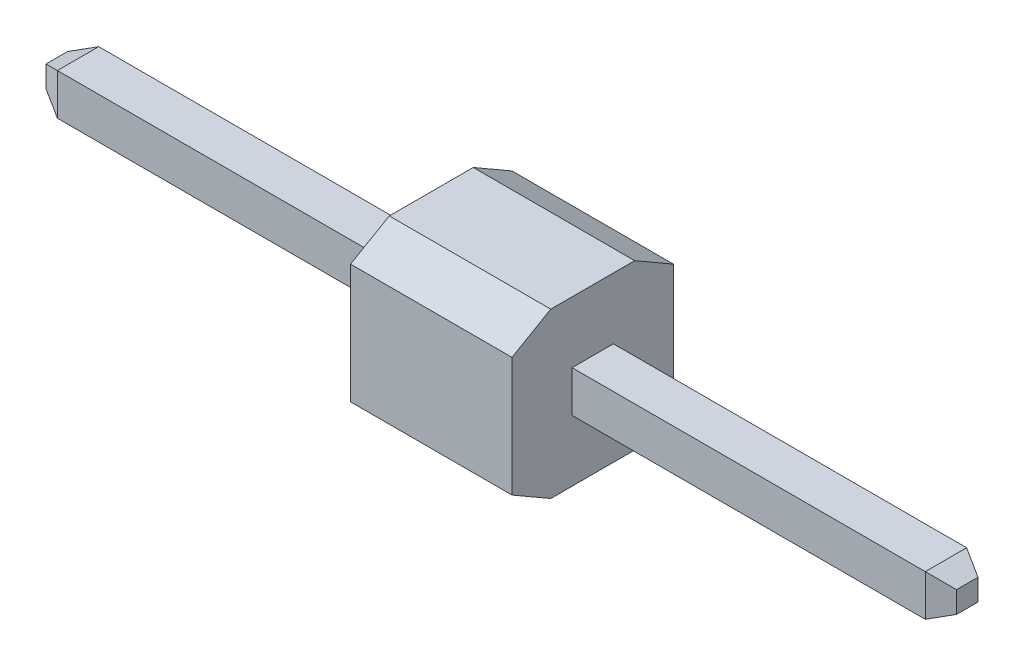
ISO-10303-21;
HEADER;
FILE_DESCRIPTION(('STEP AP214'),'2;1');
FILE_NAME('part.step','',(''),(''),'','','');
FILE_SCHEMA(('AUTOMOTIVE_DESIGN { 1 0 10303 214 1 1 1 1 }'));
ENDSEC;
DATA;
#1=APPLICATION_CONTEXT('core data for automotive mechanical design processes');
#2=APPLICATION_PROTOCOL_DEFINITION('international standard','automotive_design',2000,#1);
#3=PRODUCT_CONTEXT('',#1,'mechanical');
#4=PRODUCT('Part','Part','',(#3));
#5=PRODUCT_RELATED_PRODUCT_CATEGORY('part','',(#4));
#6=PRODUCT_DEFINITION_FORMATION('','',#4);
#7=PRODUCT_DEFINITION_CONTEXT('part definition',#1,'design');
#8=PRODUCT_DEFINITION('design','',#6,#7);
#9=PRODUCT_DEFINITION_SHAPE('','',#8);
#10=(LENGTH_UNIT() NAMED_UNIT(*) SI_UNIT(.MILLI.,.METRE.));
#11=(NAMED_UNIT(*) PLANE_ANGLE_UNIT() SI_UNIT($,.RADIAN.));
#12=(NAMED_UNIT(*) SI_UNIT($,.STERADIAN.) SOLID_ANGLE_UNIT());
#13=UNCERTAINTY_MEASURE_WITH_UNIT(LENGTH_MEASURE(1.E-05),#10,'distance_accuracy_value','');
#14=(GEOMETRIC_REPRESENTATION_CONTEXT(3) GLOBAL_UNCERTAINTY_ASSIGNED_CONTEXT((#13)) GLOBAL_UNIT_ASSIGNED_CONTEXT((#10,
#11,#12)) REPRESENTATION_CONTEXT('',''));
#15=CARTESIAN_POINT('',(0.,0.,0.));
#16=DIRECTION('',(0.,0.,1.));
#17=DIRECTION('',(1.,0.,0.));
#18=AXIS2_PLACEMENT_3D('',#15,#16,#17);
#19=CARTESIAN_POINT('',(5.42110120468803,7.93711572605714,-2.77112126172632));
#20=DIRECTION('',(1.,-9.93476518829084E-08,4.37113882867379E-08));
#21=DIRECTION('',(-9.93476589883358E-08,-1.,8.74227765734759E-08));
#22=AXIS2_PLACEMENT_3D('',#19,#20,#21);
#23=PLANE('',#22);
#24=DIRECTION('',(-1.18186632779335E-08,-0.50000007571054,-0.866025360072934));
#25=VECTOR('',#24,1.);
#26=CARTESIAN_POINT('',(5.42110101251343,6.69352602482091,-1.20112115300825));
#27=LINE('',#26,#25);
#28=CARTESIAN_POINT('',(5.42110101251343,6.69352602482091,-1.20112115300825));
#29=VERTEX_POINT('',#28);
#30=CARTESIAN_POINT('',(5.42110100432522,6.34711581085724,-1.80112112272411));
#31=VERTEX_POINT('',#30);
#32=EDGE_CURVE('E11',#29,#31,#27,.T.);
#33=ORIENTED_EDGE('',*,*,#32,.T.);
#34=DIRECTION('',(4.37113811813104E-08,-8.74227842254741E-08,-0.999999999999995));
#35=VECTOR('',#34,1.);
#36=CARTESIAN_POINT('',(5.42110100432522,6.34711581085724,-1.80112112272411));
#37=LINE('',#36,#35);
#38=CARTESIAN_POINT('',(5.42110106115001,6.34711569720762,-3.10112112272411));
#39=VERTEX_POINT('',#38);
#40=EDGE_CURVE('E304',#31,#39,#37,.T.);
#41=ORIENTED_EDGE('',*,*,#40,.T.);
#42=DIRECTION('',(8.75289963531793E-08,0.499999924289839,-0.866025447495712));
#43=VECTOR('',#42,1.);
#44=CARTESIAN_POINT('',(5.42110106115001,6.34711569720762,-3.10112112272411));
#45=LINE('',#44,#43);
#46=CARTESIAN_POINT('',(5.42110112179188,6.69352580626395,-3.70112115300825));
#47=VERTEX_POINT('',#46);
#48=EDGE_CURVE('E296',#39,#47,#45,.T.);
#49=ORIENTED_EDGE('',*,*,#48,.T.);
#50=DIRECTION('',(9.93476588436476E-08,0.999999999999991,-8.74227764822786E-08));
#51=VECTOR('',#50,1.);
#52=CARTESIAN_POINT('',(5.42110112179188,6.69352580626395,-3.70112115300825));
#53=LINE('',#52,#51);
#54=CARTESIAN_POINT('',(5.42110130530486,8.54070548323395,-3.70112131449382));
#55=VERTEX_POINT('',#54);
#56=EDGE_CURVE('E281',#47,#55,#53,.T.);
#57=ORIENTED_EDGE('',*,*,#56,.T.);
#58=DIRECTION('',(-1.18186632778483E-08,-0.500000075710534,-0.866025360072937));
#59=VECTOR('',#58,1.);
#60=CARTESIAN_POINT('',(5.42110131349307,8.88711569720762,-3.10112134477796));
#61=LINE('',#60,#59);
#62=CARTESIAN_POINT('',(5.42110131349307,8.88711569720762,-3.10112134477796));
#63=VERTEX_POINT('',#62);
#64=EDGE_CURVE('E265',#63,#55,#61,.T.);
#65=ORIENTED_EDGE('',*,*,#64,.F.);
#66=DIRECTION('',(4.37113811813104E-08,-8.74227842254741E-08,-0.999999999999995));
#67=VECTOR('',#66,1.);
#68=CARTESIAN_POINT('',(5.42110125666827,8.88711581085724,-1.80112134477796));
#69=LINE('',#68,#67);
#70=CARTESIAN_POINT('',(5.42110125666827,8.88711581085724,-1.80112134477796));
#71=VERTEX_POINT('',#70);
#72=EDGE_CURVE('E248',#71,#63,#69,.T.);
#73=ORIENTED_EDGE('',*,*,#72,.F.);
#74=DIRECTION('',(8.75289963525481E-08,0.499999924289833,-0.866025447495715));
#75=VECTOR('',#74,1.);
#76=CARTESIAN_POINT('',(5.4211011960264,8.54070570179091,-1.20112131449382));
#77=LINE('',#76,#75);
#78=CARTESIAN_POINT('',(5.4211011960264,8.54070570179091,-1.20112131449382));
#79=VERTEX_POINT('',#78);
#80=EDGE_CURVE('E242',#79,#71,#77,.T.);
#81=ORIENTED_EDGE('',*,*,#80,.F.);
#82=DIRECTION('',(9.93476588436476E-08,0.999999999999991,-8.74227762418639E-08));
#83=VECTOR('',#82,1.);
#84=CARTESIAN_POINT('',(5.42110101251343,6.69352602482091,-1.20112115300825));
#85=LINE('',#84,#83);
#86=EDGE_CURVE('E236',#29,#79,#85,.T.);
#87=ORIENTED_EDGE('',*,*,#86,.F.);
#88=EDGE_LOOP('',(#33,#41,#49,#57,#65,#73,#81,#87));
#89=FACE_BOUND('',#88,.T.);
#90=DIRECTION('',(-4.37113817364219E-08,8.74227856773042E-08,0.999999999999995));
#91=VECTOR('',#90,1.);
#92=CARTESIAN_POINT('',(5.42110114110553,7.29711572605714,-2.77112120577575));
#93=LINE('',#92,#91);
#94=CARTESIAN_POINT('',(5.42110114110553,7.29711572605714,-2.77112120577575));
#95=VERTEX_POINT('',#94);
#96=CARTESIAN_POINT('',(5.42110111313025,7.29711578200772,-2.13112120577575));
#97=VERTEX_POINT('',#96);
#98=EDGE_CURVE('E302',#95,#97,#93,.T.);
#99=ORIENTED_EDGE('',*,*,#98,.T.);
#100=DIRECTION('',(-9.93476592658906E-08,-0.999999999999991,8.74227766567418E-08));
#101=VECTOR('',#100,1.);
#102=CARTESIAN_POINT('',(5.42110117671275,7.93711578200772,-2.13112126172632));
#103=LINE('',#102,#101);
#104=CARTESIAN_POINT('',(5.42110117671275,7.93711578200772,-2.13112126172632));
#105=VERTEX_POINT('',#104);
#106=EDGE_CURVE('E293',#105,#97,#103,.T.);
#107=ORIENTED_EDGE('',*,*,#106,.F.);
#108=DIRECTION('',(-4.37113803486431E-08,8.74227856773043E-08,0.999999999999995));
#109=VECTOR('',#108,1.);
#110=CARTESIAN_POINT('',(5.42110120468803,7.93711572605714,-2.77112126172632));
#111=LINE('',#110,#109);
#112=CARTESIAN_POINT('',(5.42110120468803,7.93711572605714,-2.77112126172632));
#113=VERTEX_POINT('',#112);
#114=EDGE_CURVE('E278',#113,#105,#111,.T.);
#115=ORIENTED_EDGE('',*,*,#114,.F.);
#116=DIRECTION('',(-9.93476578781118E-08,-0.999999999999991,8.74227759628524E-08));
#117=VECTOR('',#116,1.);
#118=CARTESIAN_POINT('',(5.42110120468803,7.93711572605714,-2.77112126172632));
#119=LINE('',#118,#117);
#120=EDGE_CURVE('E263',#113,#95,#119,.T.);
#121=ORIENTED_EDGE('',*,*,#120,.T.);
#122=EDGE_LOOP('',(#99,#107,#115,#121));
#123=FACE_BOUND('',#122,.T.);
#124=ADVANCED_FACE('F17',(#89,#123),#23,.T.);
#125=CARTESIAN_POINT('',(2.92110120468803,7.93711597442627,-2.77112137100479));
#126=DIRECTION('',(1.,-9.93476518829084E-08,4.37113882867379E-08));
#127=DIRECTION('',(-9.93476589883358E-08,-1.,8.74227765734759E-08));
#128=AXIS2_PLACEMENT_3D('',#125,#126,#127);
#129=PLANE('',#128);
#130=DIRECTION('',(-1.1818662636946E-08,-0.50000007571054,-0.866025360072934));
#131=VECTOR('',#130,1.);
#132=CARTESIAN_POINT('',(2.92110101251343,6.69352627319004,-1.20112126228672));
#133=LINE('',#132,#131);
#134=CARTESIAN_POINT('',(2.92110101251343,6.69352627319004,-1.20112126228672));
#135=VERTEX_POINT('',#134);
#136=CARTESIAN_POINT('',(2.92110100432522,6.34711605922637,-1.80112123200258));
#137=VERTEX_POINT('',#136);
#138=EDGE_CURVE('E24',#135,#137,#133,.T.);
#139=ORIENTED_EDGE('',*,*,#138,.F.);
#140=DIRECTION('',(9.93476590840623E-08,0.999999999999991,-8.74227762418639E-08));
#141=VECTOR('',#140,1.);
#142=CARTESIAN_POINT('',(2.92110101251343,6.69352627319004,-1.20112126228672));
#143=LINE('',#142,#141);
#144=CARTESIAN_POINT('',(2.9211011960264,8.54070595016004,-1.20112142377229));
#145=VERTEX_POINT('',#144);
#146=EDGE_CURVE('E300',#135,#145,#143,.T.);
#147=ORIENTED_EDGE('',*,*,#146,.T.);
#148=DIRECTION('',(8.75289957115606E-08,0.499999924289833,-0.866025447495715));
#149=VECTOR('',#148,1.);
#150=CARTESIAN_POINT('',(2.9211011960264,8.54070595016004,-1.20112142377229));
#151=LINE('',#150,#149);
#152=CARTESIAN_POINT('',(2.92110125666827,8.88711605922637,-1.80112145405643));
#153=VERTEX_POINT('',#152);
#154=EDGE_CURVE('E286',#145,#153,#151,.T.);
#155=ORIENTED_EDGE('',*,*,#154,.T.);
#156=DIRECTION('',(4.37113811813104E-08,-8.74227842254741E-08,-0.999999999999995));
#157=VECTOR('',#156,1.);
#158=CARTESIAN_POINT('',(2.92110125666827,8.88711605922637,-1.80112145405643));
#159=LINE('',#158,#157);
#160=CARTESIAN_POINT('',(2.92110131349307,8.88711594557675,-3.10112145405643));
#161=VERTEX_POINT('',#160);
#162=EDGE_CURVE('E271',#153,#161,#159,.T.);
#163=ORIENTED_EDGE('',*,*,#162,.T.);
#164=DIRECTION('',(-1.18186626368607E-08,-0.500000075710534,-0.866025360072937));
#165=VECTOR('',#164,1.);
#166=CARTESIAN_POINT('',(2.92110131349307,8.88711594557675,-3.10112145405643));
#167=LINE('',#166,#165);
#168=CARTESIAN_POINT('',(2.92110130530486,8.54070573160308,-3.70112142377229));
#169=VERTEX_POINT('',#168);
#170=EDGE_CURVE('E253',#161,#169,#167,.T.);
#171=ORIENTED_EDGE('',*,*,#170,.T.);
#172=DIRECTION('',(9.93476590840623E-08,0.999999999999991,-8.74227764822786E-08));
#173=VECTOR('',#172,1.);
#174=CARTESIAN_POINT('',(2.92110112179188,6.69352605463308,-3.70112126228672));
#175=LINE('',#174,#173);
#176=CARTESIAN_POINT('',(2.92110112179188,6.69352605463308,-3.70112126228672));
#177=VERTEX_POINT('',#176);
#178=EDGE_CURVE('E261',#177,#169,#175,.T.);
#179=ORIENTED_EDGE('',*,*,#178,.F.);
#180=DIRECTION('',(8.75289957121918E-08,0.499999924289839,-0.866025447495712));
#181=VECTOR('',#180,1.);
#182=CARTESIAN_POINT('',(2.92110106115001,6.34711594557675,-3.10112123200258));
#183=LINE('',#182,#181);
#184=CARTESIAN_POINT('',(2.92110106115001,6.34711594557675,-3.10112123200258));
#185=VERTEX_POINT('',#184);
#186=EDGE_CURVE('E276',#185,#177,#183,.T.);
#187=ORIENTED_EDGE('',*,*,#186,.F.);
#188=DIRECTION('',(4.37113811813104E-08,-8.74227842254741E-08,-0.999999999999995));
#189=VECTOR('',#188,1.);
#190=CARTESIAN_POINT('',(2.92110100432522,6.34711605922637,-1.80112123200258));
#191=LINE('',#190,#189);
#192=EDGE_CURVE('E291',#137,#185,#191,.T.);
#193=ORIENTED_EDGE('',*,*,#192,.F.);
#194=EDGE_LOOP('',(#139,#147,#155,#163,#171,#179,#187,#193));
#195=FACE_BOUND('',#194,.T.);
#196=DIRECTION('',(-9.93476592658906E-08,-0.999999999999991,8.74227766567418E-08));
#197=VECTOR('',#196,1.);
#198=CARTESIAN_POINT('',(2.92110117671275,7.93711603037685,-2.13112137100479));
#199=LINE('',#198,#197);
#200=CARTESIAN_POINT('',(2.92110117671275,7.93711603037685,-2.13112137100479));
#201=VERTEX_POINT('',#200);
#202=CARTESIAN_POINT('',(2.92110111313025,7.29711603037685,-2.13112131505422));
#203=VERTEX_POINT('',#202);
#204=EDGE_CURVE('E298',#201,#203,#199,.T.);
#205=ORIENTED_EDGE('',*,*,#204,.T.);
#206=DIRECTION('',(-4.37113810425325E-08,8.74227856773042E-08,0.999999999999995));
#207=VECTOR('',#206,1.);
#208=CARTESIAN_POINT('',(2.92110114110553,7.29711597442627,-2.77112131505422));
#209=LINE('',#208,#207);
#210=CARTESIAN_POINT('',(2.92110114110553,7.29711597442627,-2.77112131505422));
#211=VERTEX_POINT('',#210);
#212=EDGE_CURVE('E283',#211,#203,#209,.T.);
#213=ORIENTED_EDGE('',*,*,#212,.F.);
#214=DIRECTION('',(-9.93476592658906E-08,-0.999999999999991,8.74227759628524E-08));
#215=VECTOR('',#214,1.);
#216=CARTESIAN_POINT('',(2.92110120468803,7.93711597442627,-2.77112137100479));
#217=LINE('',#216,#215);
#218=CARTESIAN_POINT('',(2.92110120468803,7.93711597442627,-2.77112137100479));
#219=VERTEX_POINT('',#218);
#220=EDGE_CURVE('E268',#219,#211,#217,.T.);
#221=ORIENTED_EDGE('',*,*,#220,.F.);
#222=DIRECTION('',(-4.37113810425325E-08,8.74227856773043E-08,0.999999999999995));
#223=VECTOR('',#222,1.);
#224=CARTESIAN_POINT('',(2.92110120468803,7.93711597442627,-2.77112137100479));
#225=LINE('',#224,#223);
#226=EDGE_CURVE('E251',#219,#201,#225,.T.);
#227=ORIENTED_EDGE('',*,*,#226,.T.);
#228=EDGE_LOOP('',(#205,#213,#221,#227));
#229=FACE_BOUND('',#228,.T.);
#230=ADVANCED_FACE('F314',(#195,#229),#129,.F.);
#231=CARTESIAN_POINT('',(5.42110101251343,6.69352602482091,-1.20112115300825));
#232=DIRECTION('',(1.07893287081065E-07,0.866025360072937,-0.500000075710535));
#233=DIRECTION('',(1.18186629566715E-08,0.500000075710542,0.866025360072941));
#234=AXIS2_PLACEMENT_3D('',#231,#232,#233);
#235=PLANE('',#234);
#236=ORIENTED_EDGE('',*,*,#138,.T.);
#237=DIRECTION('',(-0.999999999999994,9.93476533039933E-08,-4.37113882867377E-08));
#238=VECTOR('',#237,1.);
#239=CARTESIAN_POINT('',(5.42110100432522,6.34711581085724,-1.80112112272411));
#240=LINE('',#239,#238);
#241=EDGE_CURVE('E288',#31,#137,#240,.T.);
#242=ORIENTED_EDGE('',*,*,#241,.F.);
#243=ORIENTED_EDGE('',*,*,#32,.F.);
#244=DIRECTION('',(-0.999999999999994,9.93476504618223E-08,-4.3711388109102E-08));
#245=VECTOR('',#244,1.);
#246=CARTESIAN_POINT('',(5.42110101251343,6.69352602482091,-1.20112115300825));
#247=LINE('',#246,#245);
#248=EDGE_CURVE('E256',#29,#135,#247,.T.);
#249=ORIENTED_EDGE('',*,*,#248,.T.);
#250=EDGE_LOOP('',(#236,#242,#243,#249));
#251=FACE_BOUND('',#250,.T.);
#252=ADVANCED_FACE('F306',(#251),#235,.F.);
#253=CARTESIAN_POINT('',(5.42110100432522,6.34711581085724,-1.80112112272411));
#254=DIRECTION('',(9.93476589883358E-08,1.,-8.74227765734759E-08));
#255=DIRECTION('',(1.,-9.93476518829084E-08,4.37113882867379E-08));
#256=AXIS2_PLACEMENT_3D('',#253,#254,#255);
#257=PLANE('',#256);
#258=ORIENTED_EDGE('',*,*,#192,.T.);
#259=DIRECTION('',(-0.999999999999994,9.93476533039933E-08,-4.37113882867377E-08));
#260=VECTOR('',#259,1.);
#261=CARTESIAN_POINT('',(5.42110106115001,6.34711569720762,-3.10112112272411));
#262=LINE('',#261,#260);
#263=EDGE_CURVE('E273',#39,#185,#262,.T.);
#264=ORIENTED_EDGE('',*,*,#263,.F.);
#265=ORIENTED_EDGE('',*,*,#40,.F.);
#266=ORIENTED_EDGE('',*,*,#241,.T.);
#267=EDGE_LOOP('',(#258,#264,#265,#266));
#268=FACE_BOUND('',#267,.T.);
#269=ADVANCED_FACE('F311',(#268),#257,.F.);
#270=CARTESIAN_POINT('',(5.42110106115001,6.34711569720762,-3.10112112272411));
#271=DIRECTION('',(6.41819058997377E-08,0.866025447495721,0.499999924289845));
#272=DIRECTION('',(-8.7528996031702E-08,-0.499999924289838,0.866025447495717));
#273=AXIS2_PLACEMENT_3D('',#270,#271,#272);
#274=PLANE('',#273);
#275=ORIENTED_EDGE('',*,*,#186,.T.);
#276=DIRECTION('',(-0.999999999999994,9.93476504618223E-08,-4.37113882867377E-08));
#277=VECTOR('',#276,1.);
#278=CARTESIAN_POINT('',(5.42110112179188,6.69352580626395,-3.70112115300825));
#279=LINE('',#278,#277);
#280=EDGE_CURVE('E258',#47,#177,#279,.T.);
#281=ORIENTED_EDGE('',*,*,#280,.F.);
#282=ORIENTED_EDGE('',*,*,#48,.F.);
#283=ORIENTED_EDGE('',*,*,#263,.T.);
#284=EDGE_LOOP('',(#275,#281,#282,#283));
#285=FACE_BOUND('',#284,.T.);
#286=ADVANCED_FACE('F319',(#285),#274,.F.);
#287=CARTESIAN_POINT('',(5.42110112179188,6.69352580626395,-3.70112115300825));
#288=DIRECTION('',(-4.37113811813106E-08,8.74227836789032E-08,1.));
#289=DIRECTION('',(-1.,9.93476518829084E-08,-4.37113882867379E-08));
#290=AXIS2_PLACEMENT_3D('',#287,#288,#289);
#291=PLANE('',#290);
#292=ORIENTED_EDGE('',*,*,#178,.T.);
#293=DIRECTION('',(-0.999999999999994,9.93476504618223E-08,-4.37113882867377E-08));
#294=VECTOR('',#293,1.);
#295=CARTESIAN_POINT('',(5.42110130530486,8.54070548323395,-3.70112131449382));
#296=LINE('',#295,#294);
#297=EDGE_CURVE('E245',#55,#169,#296,.T.);
#298=ORIENTED_EDGE('',*,*,#297,.F.);
#299=ORIENTED_EDGE('',*,*,#56,.F.);
#300=ORIENTED_EDGE('',*,*,#280,.T.);
#301=EDGE_LOOP('',(#292,#298,#299,#300));
#302=FACE_BOUND('',#301,.T.);
#303=ADVANCED_FACE('F326',(#302),#291,.F.);
#304=CARTESIAN_POINT('',(5.42110131349307,8.88711569720762,-3.10112134477796));
#305=DIRECTION('',(1.07893287081065E-07,0.866025360072937,-0.500000075710535));
#306=DIRECTION('',(1.18186629566715E-08,0.500000075710542,0.866025360072941));
#307=AXIS2_PLACEMENT_3D('',#304,#305,#306);
#308=PLANE('',#307);
#309=ORIENTED_EDGE('',*,*,#170,.F.);
#310=DIRECTION('',(-0.999999999999994,9.93476504618223E-08,-4.37113882867377E-08));
#311=VECTOR('',#310,1.);
#312=CARTESIAN_POINT('',(5.42110131349307,8.88711569720762,-3.10112134477796));
#313=LINE('',#312,#311);
#314=EDGE_CURVE('E239',#63,#161,#313,.T.);
#315=ORIENTED_EDGE('',*,*,#314,.F.);
#316=ORIENTED_EDGE('',*,*,#64,.T.);
#317=ORIENTED_EDGE('',*,*,#297,.T.);
#318=EDGE_LOOP('',(#309,#315,#316,#317));
#319=FACE_BOUND('',#318,.T.);
#320=ADVANCED_FACE('F329',(#319),#308,.T.);
#321=CARTESIAN_POINT('',(5.42110125666827,8.88711581085724,-1.80112134477796));
#322=DIRECTION('',(9.93476589883358E-08,1.,-8.74227765734759E-08));
#323=DIRECTION('',(1.,-9.93476518829084E-08,4.37113882867379E-08));
#324=AXIS2_PLACEMENT_3D('',#321,#322,#323);
#325=PLANE('',#324);
#326=ORIENTED_EDGE('',*,*,#162,.F.);
#327=DIRECTION('',(-0.999999999999994,9.93476504618223E-08,-4.37113884643734E-08));
#328=VECTOR('',#327,1.);
#329=CARTESIAN_POINT('',(5.42110125666827,8.88711581085724,-1.80112134477796));
#330=LINE('',#329,#328);
#331=EDGE_CURVE('E233',#71,#153,#330,.T.);
#332=ORIENTED_EDGE('',*,*,#331,.F.);
#333=ORIENTED_EDGE('',*,*,#72,.T.);
#334=ORIENTED_EDGE('',*,*,#314,.T.);
#335=EDGE_LOOP('',(#326,#332,#333,#334));
#336=FACE_BOUND('',#335,.T.);
#337=ADVANCED_FACE('F333',(#336),#325,.T.);
#338=CARTESIAN_POINT('',(5.4211011960264,8.54070570179091,-1.20112131449382));
#339=DIRECTION('',(6.41819058997377E-08,0.866025447495721,0.499999924289845));
#340=DIRECTION('',(-8.7528996031702E-08,-0.499999924289838,0.866025447495717));
#341=AXIS2_PLACEMENT_3D('',#338,#339,#340);
#342=PLANE('',#341);
#343=ORIENTED_EDGE('',*,*,#154,.F.);
#344=DIRECTION('',(-0.999999999999994,9.93476504618223E-08,-4.3711388109102E-08));
#345=VECTOR('',#344,1.);
#346=CARTESIAN_POINT('',(5.4211011960264,8.54070570179091,-1.20112131449382));
#347=LINE('',#346,#345);
#348=EDGE_CURVE('E230',#79,#145,#347,.T.);
#349=ORIENTED_EDGE('',*,*,#348,.F.);
#350=ORIENTED_EDGE('',*,*,#80,.T.);
#351=ORIENTED_EDGE('',*,*,#331,.T.);
#352=EDGE_LOOP('',(#343,#349,#350,#351));
#353=FACE_BOUND('',#352,.T.);
#354=ADVANCED_FACE('F337',(#353),#342,.T.);
#355=CARTESIAN_POINT('',(5.42110101251343,6.69352602482091,-1.20112115300825));
#356=DIRECTION('',(-4.37113811813106E-08,8.74227835615132E-08,1.));
#357=DIRECTION('',(-9.93476589883358E-08,-1.,8.74227764560859E-08));
#358=AXIS2_PLACEMENT_3D('',#355,#356,#357);
#359=PLANE('',#358);
#360=ORIENTED_EDGE('',*,*,#146,.F.);
#361=ORIENTED_EDGE('',*,*,#248,.F.);
#362=ORIENTED_EDGE('',*,*,#86,.T.);
#363=ORIENTED_EDGE('',*,*,#348,.T.);
#364=EDGE_LOOP('',(#360,#361,#362,#363));
#365=FACE_BOUND('',#364,.T.);
#366=ADVANCED_FACE('F339',(#365),#359,.T.);
#367=CARTESIAN_POINT('',(-2.87889879531197,7.93711655064265,-2.77112162453085));
#368=DIRECTION('',(-1.,9.93476518829084E-08,-4.37113882867379E-08));
#369=DIRECTION('',(9.93476589883358E-08,1.,-8.74227765734759E-08));
#370=AXIS2_PLACEMENT_3D('',#367,#368,#369);
#371=PLANE('',#370);
#372=DIRECTION('',(9.93476634944484E-08,0.999999999999991,-8.7422776141512E-08));
#373=VECTOR('',#372,1.);
#374=CARTESIAN_POINT('',(-2.87889886485561,7.45099812033048,-2.28500310922402));
#375=LINE('',#374,#373);
#376=CARTESIAN_POINT('',(-2.87889886485561,7.45099812033048,-2.28500310922402));
#377=VERTEX_POINT('',#376);
#378=CARTESIAN_POINT('',(-2.87889883184864,7.78323506594048,-2.2850031382691));
#379=VERTEX_POINT('',#378);
#380=EDGE_CURVE('E228',#377,#379,#375,.T.);
#381=ORIENTED_EDGE('',*,*,#380,.T.);
#382=DIRECTION('',(4.37113793813867E-08,-8.74227854960561E-08,-0.999999999999995));
#383=VECTOR('',#382,1.);
#384=CARTESIAN_POINT('',(-2.87889883184865,7.78323506594048,-2.2850031382691));
#385=LINE('',#384,#383);
#386=CARTESIAN_POINT('',(-2.87889881732611,7.7832350368954,-2.6172400838871));
#387=VERTEX_POINT('',#386);
#388=EDGE_CURVE('E223',#379,#387,#385,.T.);
#389=ORIENTED_EDGE('',*,*,#388,.T.);
#390=DIRECTION('',(-9.93476608211201E-08,-0.999999999999991,8.7422776141512E-08));
#391=VECTOR('',#390,1.);
#392=CARTESIAN_POINT('',(-2.87889881732611,7.7832350368954,-2.6172400838871));
#393=LINE('',#392,#391);
#394=CARTESIAN_POINT('',(-2.87889885033307,7.4509980912854,-2.61724005484202));
#395=VERTEX_POINT('',#394);
#396=EDGE_CURVE('E215',#387,#395,#393,.T.);
#397=ORIENTED_EDGE('',*,*,#396,.T.);
#398=DIRECTION('',(-4.37113767080584E-08,8.7422774802743E-08,0.999999999999995));
#399=VECTOR('',#398,1.);
#400=CARTESIAN_POINT('',(-2.87889885033307,7.4509980912854,-2.61724005484202));
#401=LINE('',#400,#399);
#402=EDGE_CURVE('E207',#395,#377,#401,.T.);
#403=ORIENTED_EDGE('',*,*,#402,.T.);
#404=EDGE_LOOP('',(#381,#389,#397,#403));
#405=FACE_BOUND('',#404,.T.);
#406=ADVANCED_FACE('F341',(#405),#371,.T.);
#407=CARTESIAN_POINT('',(-2.87889879531197,7.93711655064265,-2.77112162453085));
#408=DIRECTION('',(9.93476589883358E-08,1.,-8.74227764510112E-08));
#409=DIRECTION('',(-4.37113811813106E-08,8.74227835564385E-08,1.));
#410=AXIS2_PLACEMENT_3D('',#407,#408,#409);
#411=PLANE('',#410);
#412=DIRECTION('',(0.999999999999994,-9.93476534027159E-08,4.37113883581816E-08));
#413=VECTOR('',#412,1.);
#414=CARTESIAN_POINT('',(-2.54889879531197,7.93711651785793,-2.77112161010609));
#415=LINE('',#414,#413);
#416=CARTESIAN_POINT('',(-2.54889879531197,7.93711651785793,-2.77112161010609));
#417=VERTEX_POINT('',#416);
#418=EDGE_CURVE('E225',#417,#219,#415,.T.);
#419=ORIENTED_EDGE('',*,*,#418,.F.);
#420=DIRECTION('',(-4.37113803486431E-08,8.74227856773042E-08,0.999999999999995));
#421=VECTOR('',#420,1.);
#422=CARTESIAN_POINT('',(-2.54889879531197,7.93711651785793,-2.77112161010609));
#423=LINE('',#422,#421);
#424=CARTESIAN_POINT('',(-2.54889882328725,7.93711657380851,-2.13112161010609));
#425=VERTEX_POINT('',#424);
#426=EDGE_CURVE('E217',#417,#425,#423,.T.);
#427=ORIENTED_EDGE('',*,*,#426,.T.);
#428=DIRECTION('',(0.999999999999994,-9.93476534027159E-08,4.3711388195809E-08));
#429=VECTOR('',#428,1.);
#430=CARTESIAN_POINT('',(-2.54889882328725,7.93711657380851,-2.13112161010609));
#431=LINE('',#430,#429);
#432=EDGE_CURVE('E220',#425,#201,#431,.T.);
#433=ORIENTED_EDGE('',*,*,#432,.T.);
#434=ORIENTED_EDGE('',*,*,#226,.F.);
#435=EDGE_LOOP('',(#419,#427,#433,#434));
#436=FACE_BOUND('',#435,.T.);
#437=ADVANCED_FACE('F348',(#436),#411,.T.);
#438=CARTESIAN_POINT('',(-2.87889882328725,7.93711660659323,-2.13112162453085));
#439=DIRECTION('',(-4.37113811813106E-08,8.74227836789032E-08,1.));
#440=DIRECTION('',(-1.,9.93476518829084E-08,-4.37113882867379E-08));
#441=AXIS2_PLACEMENT_3D('',#438,#439,#440);
#442=PLANE('',#441);
#443=ORIENTED_EDGE('',*,*,#432,.F.);
#444=DIRECTION('',(-9.93476592658906E-08,-0.999999999999991,8.74227766567418E-08));
#445=VECTOR('',#444,1.);
#446=CARTESIAN_POINT('',(-2.54889882328725,7.93711657380851,-2.13112161010609));
#447=LINE('',#446,#445);
#448=CARTESIAN_POINT('',(-2.54889888686975,7.29711657380851,-2.13112155415551));
#449=VERTEX_POINT('',#448);
#450=EDGE_CURVE('E209',#425,#449,#447,.T.);
#451=ORIENTED_EDGE('',*,*,#450,.T.);
#452=DIRECTION('',(0.999999999999994,-9.93476534027159E-08,4.37113882769953E-08));
#453=VECTOR('',#452,1.);
#454=CARTESIAN_POINT('',(-2.54889888686975,7.29711657380851,-2.13112155415551));
#455=LINE('',#454,#453);
#456=EDGE_CURVE('E212',#449,#203,#455,.T.);
#457=ORIENTED_EDGE('',*,*,#456,.T.);
#458=ORIENTED_EDGE('',*,*,#204,.F.);
#459=EDGE_LOOP('',(#443,#451,#457,#458));
#460=FACE_BOUND('',#459,.T.);
#461=ADVANCED_FACE('F424',(#460),#442,.T.);
#462=CARTESIAN_POINT('',(-2.87889885889447,7.29711655064265,-2.77112156858027));
#463=DIRECTION('',(9.93476589883357E-08,1.,-8.74227764040693E-08));
#464=DIRECTION('',(-4.37113811813106E-08,8.74227835094966E-08,1.));
#465=AXIS2_PLACEMENT_3D('',#462,#463,#464);
#466=PLANE('',#465);
#467=ORIENTED_EDGE('',*,*,#456,.F.);
#468=DIRECTION('',(4.37113831242006E-08,-8.74227967795345E-08,-0.999999999999995));
#469=VECTOR('',#468,1.);
#470=CARTESIAN_POINT('',(-2.54889888686975,7.29711657380852,-2.13112155415551));
#471=LINE('',#470,#469);
#472=CARTESIAN_POINT('',(-2.54889885889447,7.29711651785793,-2.77112155415551));
#473=VERTEX_POINT('',#472);
#474=EDGE_CURVE('E201',#449,#473,#471,.T.);
#475=ORIENTED_EDGE('',*,*,#474,.T.);
#476=DIRECTION('',(0.999999999999994,-9.93476534027159E-08,4.37113882769953E-08));
#477=VECTOR('',#476,1.);
#478=CARTESIAN_POINT('',(-2.54889885889447,7.29711651785793,-2.77112155415551));
#479=LINE('',#478,#477);
#480=EDGE_CURVE('E204',#473,#211,#479,.T.);
#481=ORIENTED_EDGE('',*,*,#480,.T.);
#482=ORIENTED_EDGE('',*,*,#212,.T.);
#483=EDGE_LOOP('',(#467,#475,#481,#482));
#484=FACE_BOUND('',#483,.T.);
#485=ADVANCED_FACE('F421',(#484),#466,.F.);
#486=CARTESIAN_POINT('',(-2.87889879531197,7.93711655064265,-2.77112162453085));
#487=DIRECTION('',(-4.37113811813106E-08,8.74227836789032E-08,1.));
#488=DIRECTION('',(-1.,9.93476518829084E-08,-4.37113882867379E-08));
#489=AXIS2_PLACEMENT_3D('',#486,#487,#488);
#490=PLANE('',#489);
#491=ORIENTED_EDGE('',*,*,#480,.F.);
#492=DIRECTION('',(9.9347656490333E-08,0.999999999999991,-8.74227766567418E-08));
#493=VECTOR('',#492,1.);
#494=CARTESIAN_POINT('',(-2.54889885889447,7.29711651785793,-2.77112155415551));
#495=LINE('',#494,#493);
#496=EDGE_CURVE('E196',#473,#417,#495,.T.);
#497=ORIENTED_EDGE('',*,*,#496,.T.);
#498=ORIENTED_EDGE('',*,*,#418,.T.);
#499=ORIENTED_EDGE('',*,*,#220,.T.);
#500=EDGE_LOOP('',(#491,#497,#498,#499));
#501=FACE_BOUND('',#500,.T.);
#502=ADVANCED_FACE('F376',(#501),#490,.F.);
#503=CARTESIAN_POINT('',(-2.87889879531197,7.93711655064265,-2.77112162453085));
#504=DIRECTION('',(-4.37113811813106E-08,8.74227836789032E-08,1.));
#505=DIRECTION('',(-1.,9.93476518829084E-08,-4.37113882867379E-08));
#506=AXIS2_PLACEMENT_3D('',#503,#504,#505);
#507=PLANE('',#506);
#508=DIRECTION('',(0.999999999999994,-9.93476521037346E-08,4.37113882769953E-08));
#509=VECTOR('',#508,1.);
#510=CARTESIAN_POINT('',(5.42110120468803,7.93711572605713,-2.77112126172632));
#511=LINE('',#510,#509);
#512=CARTESIAN_POINT('',(10.891101204688,7.93711518262548,-2.77112102262503));
#513=VERTEX_POINT('',#512);
#514=EDGE_CURVE('E199',#113,#513,#511,.T.);
#515=ORIENTED_EDGE('',*,*,#514,.T.);
#516=DIRECTION('',(-9.93476606536693E-08,-0.999999999999991,8.74227766567418E-08));
#517=VECTOR('',#516,1.);
#518=CARTESIAN_POINT('',(10.891101204688,7.93711518262548,-2.77112102262503));
#519=LINE('',#518,#517);
#520=CARTESIAN_POINT('',(10.8911011411055,7.29711518262548,-2.77112096667445));
#521=VERTEX_POINT('',#520);
#522=EDGE_CURVE('E191',#513,#521,#519,.T.);
#523=ORIENTED_EDGE('',*,*,#522,.T.);
#524=DIRECTION('',(0.999999999999994,-9.93476469078097E-08,4.37113883581817E-08));
#525=VECTOR('',#524,1.);
#526=CARTESIAN_POINT('',(5.42110114110553,7.29711572605715,-2.77112120577575));
#527=LINE('',#526,#525);
#528=EDGE_CURVE('E194',#95,#521,#527,.T.);
#529=ORIENTED_EDGE('',*,*,#528,.F.);
#530=ORIENTED_EDGE('',*,*,#120,.F.);
#531=EDGE_LOOP('',(#515,#523,#529,#530));
#532=FACE_BOUND('',#531,.T.);
#533=ADVANCED_FACE('F367',(#532),#507,.F.);
#534=CARTESIAN_POINT('',(-2.87889885889447,7.29711655064265,-2.77112156858027));
#535=DIRECTION('',(9.93476589883357E-08,1.,-8.74227764040693E-08));
#536=DIRECTION('',(-4.37113811813106E-08,8.74227835094966E-08,1.));
#537=AXIS2_PLACEMENT_3D('',#534,#535,#536);
#538=PLANE('',#537);
#539=ORIENTED_EDGE('',*,*,#528,.T.);
#540=DIRECTION('',(-4.37113845119795E-08,8.74227856773043E-08,0.999999999999995));
#541=VECTOR('',#540,1.);
#542=CARTESIAN_POINT('',(10.8911011411055,7.29711518262548,-2.77112096667445));
#543=LINE('',#542,#541);
#544=CARTESIAN_POINT('',(10.8911011131302,7.29711523857607,-2.13112096667445));
#545=VERTEX_POINT('',#544);
#546=EDGE_CURVE('E186',#521,#545,#543,.T.);
#547=ORIENTED_EDGE('',*,*,#546,.T.);
#548=DIRECTION('',(0.999999999999994,-9.93476469078097E-08,4.37113880334363E-08));
#549=VECTOR('',#548,1.);
#550=CARTESIAN_POINT('',(5.42110111313025,7.29711578200773,-2.13112120577575));
#551=LINE('',#550,#549);
#552=EDGE_CURVE('E189',#97,#545,#551,.T.);
#553=ORIENTED_EDGE('',*,*,#552,.F.);
#554=ORIENTED_EDGE('',*,*,#98,.F.);
#555=EDGE_LOOP('',(#539,#547,#553,#554));
#556=FACE_BOUND('',#555,.T.);
#557=ADVANCED_FACE('F364',(#556),#538,.F.);
#558=CARTESIAN_POINT('',(-2.87889882328725,7.93711660659323,-2.13112162453085));
#559=DIRECTION('',(-4.37113811813106E-08,8.74227836789032E-08,1.));
#560=DIRECTION('',(-1.,9.93476518829084E-08,-4.37113882867379E-08));
#561=AXIS2_PLACEMENT_3D('',#558,#559,#560);
#562=PLANE('',#561);
#563=ORIENTED_EDGE('',*,*,#552,.T.);
#564=DIRECTION('',(9.93476606536693E-08,0.999999999999991,-8.74227766567418E-08));
#565=VECTOR('',#564,1.);
#566=CARTESIAN_POINT('',(10.8911011131302,7.29711523857607,-2.13112096667445));
#567=LINE('',#566,#565);
#568=CARTESIAN_POINT('',(10.8911011767128,7.93711523857607,-2.13112102262503));
#569=VERTEX_POINT('',#568);
#570=EDGE_CURVE('E176',#545,#569,#567,.T.);
#571=ORIENTED_EDGE('',*,*,#570,.T.);
#572=DIRECTION('',(0.999999999999994,-9.93476521037347E-08,4.3711388195809E-08));
#573=VECTOR('',#572,1.);
#574=CARTESIAN_POINT('',(5.42110117671275,7.93711578200772,-2.13112126172632));
#575=LINE('',#574,#573);
#576=EDGE_CURVE('E179',#105,#569,#575,.T.);
#577=ORIENTED_EDGE('',*,*,#576,.F.);
#578=ORIENTED_EDGE('',*,*,#106,.T.);
#579=EDGE_LOOP('',(#563,#571,#577,#578));
#580=FACE_BOUND('',#579,.T.);
#581=ADVANCED_FACE('F366',(#580),#562,.T.);
#582=CARTESIAN_POINT('',(-2.87889879531197,7.93711655064265,-2.77112162453085));
#583=DIRECTION('',(9.93476589883358E-08,1.,-8.74227764510112E-08));
#584=DIRECTION('',(-4.37113811813106E-08,8.74227835564385E-08,1.));
#585=AXIS2_PLACEMENT_3D('',#582,#583,#584);
#586=PLANE('',#585);
#587=ORIENTED_EDGE('',*,*,#576,.T.);
#588=DIRECTION('',(4.37113789608643E-08,-8.74227856773043E-08,-0.999999999999995));
#589=VECTOR('',#588,1.);
#590=CARTESIAN_POINT('',(10.8911011767128,7.93711523857607,-2.13112102262503));
#591=LINE('',#590,#589);
#592=EDGE_CURVE('E167',#569,#513,#591,.T.);
#593=ORIENTED_EDGE('',*,*,#592,.T.);
#594=ORIENTED_EDGE('',*,*,#514,.F.);
#595=ORIENTED_EDGE('',*,*,#114,.T.);
#596=EDGE_LOOP('',(#587,#593,#594,#595));
#597=FACE_BOUND('',#596,.T.);
#598=ADVANCED_FACE('F373',(#597),#586,.T.);
#599=CARTESIAN_POINT('',(11.221101204688,7.93711514984076,-2.77112100820027));
#600=DIRECTION('',(-1.,9.93476518829084E-08,-4.37113882867379E-08));
#601=DIRECTION('',(9.93476589883358E-08,1.,-8.74227765734759E-08));
#602=AXIS2_PLACEMENT_3D('',#599,#600,#601);
#603=PLANE('',#602);
#604=DIRECTION('',(-9.93476581477919E-08,-0.999999999999991,8.7422776141512E-08));
#605=VECTOR('',#604,1.);
#606=CARTESIAN_POINT('',(11.2211011681514,7.78323366513859,-2.28500252193852));
#607=LINE('',#606,#605);
#608=CARTESIAN_POINT('',(11.2211011681514,7.78323366513859,-2.28500252193852));
#609=VERTEX_POINT('',#608);
#610=CARTESIAN_POINT('',(11.2211011351444,7.45099671952859,-2.28500249289345));
#611=VERTEX_POINT('',#610);
#612=EDGE_CURVE('E153',#609,#611,#607,.T.);
#613=ORIENTED_EDGE('',*,*,#612,.T.);
#614=DIRECTION('',(4.37113820547149E-08,-8.74227961893691E-08,-0.999999999999995));
#615=VECTOR('',#614,1.);
#616=CARTESIAN_POINT('',(11.2211011351444,7.4509967195286,-2.28500249289345));
#617=LINE('',#616,#615);
#618=CARTESIAN_POINT('',(11.2211011496669,7.45099669048351,-2.61723943851144));
#619=VERTEX_POINT('',#618);
#620=EDGE_CURVE('E395',#611,#619,#617,.T.);
#621=ORIENTED_EDGE('',*,*,#620,.T.);
#622=DIRECTION('',(9.93476581477919E-08,0.999999999999991,-8.74227774781761E-08));
#623=VECTOR('',#622,1.);
#624=CARTESIAN_POINT('',(11.2211011496669,7.45099669048351,-2.61723943851144));
#625=LINE('',#624,#623);
#626=CARTESIAN_POINT('',(11.2211011826739,7.78323363609351,-2.61723946755652));
#627=VERTEX_POINT('',#626);
#628=EDGE_CURVE('E156',#619,#627,#625,.T.);
#629=ORIENTED_EDGE('',*,*,#628,.T.);
#630=DIRECTION('',(-4.37113874013715E-08,8.74227854960561E-08,0.999999999999995));
#631=VECTOR('',#630,1.);
#632=CARTESIAN_POINT('',(11.2211011826739,7.78323363609351,-2.61723946755652));
#633=LINE('',#632,#631);
#634=EDGE_CURVE('E149',#627,#609,#633,.T.);
#635=ORIENTED_EDGE('',*,*,#634,.T.);
#636=EDGE_LOOP('',(#613,#621,#629,#635));
#637=FACE_BOUND('',#636,.T.);
#638=ADVANCED_FACE('F151',(#637),#603,.F.);
#639=CARTESIAN_POINT('',(-2.8788988436067,7.45099807783265,-2.77112158203302));
#640=DIRECTION('',(-0.422618351780369,-0.906307745050466,6.07587120833484E-08));
#641=DIRECTION('',(4.37113811813106E-08,-8.74227835094966E-08,-1.));
#642=AXIS2_PLACEMENT_3D('',#639,#640,#641);
#643=PLANE('',#642);
#644=DIRECTION('',(0.834817073788752,-0.389281669540032,0.3892816911581));
#645=VECTOR('',#644,1.);
#646=CARTESIAN_POINT('',(-2.87889886485563,7.45099812032996,-2.2850031092245));
#647=LINE('',#646,#645);
#648=EDGE_CURVE('E181',#377,#449,#647,.T.);
#649=ORIENTED_EDGE('',*,*,#648,.F.);
#650=ORIENTED_EDGE('',*,*,#402,.F.);
#651=DIRECTION('',(-0.834817107820827,0.389281737604197,0.389281550111904));
#652=VECTOR('',#651,1.);
#653=CARTESIAN_POINT('',(-2.5488988588949,7.29711651785646,-2.77112155415497));
#654=LINE('',#653,#652);
#655=EDGE_CURVE('E404',#473,#395,#654,.T.);
#656=ORIENTED_EDGE('',*,*,#655,.F.);
#657=ORIENTED_EDGE('',*,*,#474,.F.);
#658=EDGE_LOOP('',(#649,#650,#656,#657));
#659=FACE_BOUND('',#658,.T.);
#660=ADVANCED_FACE('F418',(#659),#643,.T.);
#661=CARTESIAN_POINT('',(-2.87889880203834,7.9371165640954,-2.61724009733985));
#662=DIRECTION('',(-0.422618222124847,-3.72458176658199E-08,-0.906307805509828));
#663=DIRECTION('',(9.93476589883358E-08,1.,-8.74227765734759E-08));
#664=AXIS2_PLACEMENT_3D('',#661,#662,#663);
#665=PLANE('',#664);
#666=ORIENTED_EDGE('',*,*,#655,.T.);
#667=ORIENTED_EDGE('',*,*,#396,.F.);
#668=DIRECTION('',(-0.834817185169254,-0.389281503665803,0.389281618176064));
#669=VECTOR('',#668,1.);
#670=CARTESIAN_POINT('',(-2.54889879531082,7.9371165178552,-2.77112161010636));
#671=LINE('',#670,#669);
#672=EDGE_CURVE('E160',#417,#387,#671,.T.);
#673=ORIENTED_EDGE('',*,*,#672,.F.);
#674=ORIENTED_EDGE('',*,*,#496,.F.);
#675=EDGE_LOOP('',(#666,#667,#673,#674));
#676=FACE_BOUND('',#675,.T.);
#677=ADVANCED_FACE('F434',(#676),#665,.T.);
#678=CARTESIAN_POINT('',(-2.54889882328725,7.93711657380851,-2.13112161010609));
#679=DIRECTION('',(0.422618301356777,-1.21218081559392E-07,-0.906307768563367));
#680=DIRECTION('',(-9.93476589883358E-08,-1.,8.74227765734759E-08));
#681=AXIS2_PLACEMENT_3D('',#678,#679,#680);
#682=PLANE('',#681);
#683=ORIENTED_EDGE('',*,*,#648,.T.);
#684=ORIENTED_EDGE('',*,*,#450,.F.);
#685=DIRECTION('',(0.834817151137179,0.38928157172997,0.389281623093934));
#686=VECTOR('',#685,1.);
#687=CARTESIAN_POINT('',(-2.87889883185148,7.78323506594802,-2.28500313827056));
#688=LINE('',#687,#686);
#689=EDGE_CURVE('E170',#379,#425,#688,.T.);
#690=ORIENTED_EDGE('',*,*,#689,.F.);
#691=ORIENTED_EDGE('',*,*,#380,.F.);
#692=EDGE_LOOP('',(#683,#684,#690,#691));
#693=FACE_BOUND('',#692,.T.);
#694=ADVANCED_FACE('F413',(#693),#682,.F.);
#695=CARTESIAN_POINT('',(-2.54889879531197,7.93711651785793,-2.77112161010609));
#696=DIRECTION('',(0.422618171701255,-0.906307829022729,9.770517399793E-08));
#697=DIRECTION('',(-4.37113811813106E-08,8.74227835564385E-08,1.));
#698=AXIS2_PLACEMENT_3D('',#695,#696,#697);
#699=PLANE('',#698);
#700=ORIENTED_EDGE('',*,*,#672,.T.);
#701=ORIENTED_EDGE('',*,*,#388,.F.);
#702=ORIENTED_EDGE('',*,*,#689,.T.);
#703=ORIENTED_EDGE('',*,*,#426,.F.);
#704=EDGE_LOOP('',(#700,#701,#702,#703));
#705=FACE_BOUND('',#704,.T.);
#706=ADVANCED_FACE('F429',(#705),#699,.F.);
#707=CARTESIAN_POINT('',(11.2211011894003,7.78323362264076,-2.77112099474752));
#708=DIRECTION('',(0.422618351780369,0.906307745050466,-6.07587121258922E-08));
#709=DIRECTION('',(4.37113811813106E-08,-8.74227835564385E-08,-1.));
#710=AXIS2_PLACEMENT_3D('',#707,#708,#709);
#711=PLANE('',#710);
#712=DIRECTION('',(-0.834817107820824,0.389281737604203,0.389281550111906));
#713=VECTOR('',#712,1.);
#714=CARTESIAN_POINT('',(11.2211011681514,7.78323366513911,-2.285002521939));
#715=LINE('',#714,#713);
#716=EDGE_CURVE('E164',#609,#569,#715,.T.);
#717=ORIENTED_EDGE('',*,*,#716,.F.);
#718=ORIENTED_EDGE('',*,*,#634,.F.);
#719=DIRECTION('',(0.834817073788751,-0.389281669540036,0.389281691158099));
#720=VECTOR('',#719,1.);
#721=CARTESIAN_POINT('',(10.891101204688,7.93711518262548,-2.77112102262503));
#722=LINE('',#721,#720);
#723=EDGE_CURVE('E392',#513,#627,#722,.T.);
#724=ORIENTED_EDGE('',*,*,#723,.F.);
#725=ORIENTED_EDGE('',*,*,#592,.F.);
#726=EDGE_LOOP('',(#717,#718,#724,#725));
#727=FACE_BOUND('',#726,.T.);
#728=ADVANCED_FACE('F165',(#727),#711,.T.);
#729=CARTESIAN_POINT('',(10.891101204688,7.93711518262548,-2.77112102262503));
#730=DIRECTION('',(-0.422618301356777,1.21218081559392E-07,0.906307768563367));
#731=DIRECTION('',(-9.93476589883358E-08,-1.,8.74227765734759E-08));
#732=AXIS2_PLACEMENT_3D('',#729,#730,#731);
#733=PLANE('',#732);
#734=ORIENTED_EDGE('',*,*,#723,.T.);
#735=ORIENTED_EDGE('',*,*,#628,.F.);
#736=DIRECTION('',(0.834817151137177,0.389281571729974,0.389281623093935));
#737=VECTOR('',#736,1.);
#738=CARTESIAN_POINT('',(10.8911011411071,7.29711518262127,-2.77112096667355));
#739=LINE('',#738,#737);
#740=EDGE_CURVE('E389',#521,#619,#739,.T.);
#741=ORIENTED_EDGE('',*,*,#740,.F.);
#742=ORIENTED_EDGE('',*,*,#522,.F.);
#743=EDGE_LOOP('',(#734,#735,#741,#742));
#744=FACE_BOUND('',#743,.T.);
#745=ADVANCED_FACE('F390',(#744),#733,.F.);
#746=CARTESIAN_POINT('',(11.2211011834391,7.93711519233859,-2.28500253539127));
#747=DIRECTION('',(0.422618222124847,3.72458176658199E-08,0.906307805509828));
#748=DIRECTION('',(9.93476589883358E-08,1.,-8.74227765734759E-08));
#749=AXIS2_PLACEMENT_3D('',#746,#747,#748);
#750=PLANE('',#749);
#751=ORIENTED_EDGE('',*,*,#716,.T.);
#752=ORIENTED_EDGE('',*,*,#570,.F.);
#753=DIRECTION('',(-0.834817185169255,-0.389281503665799,0.389281618176066));
#754=VECTOR('',#753,1.);
#755=CARTESIAN_POINT('',(11.2211011351444,7.45099671952807,-2.28500249289393));
#756=LINE('',#755,#754);
#757=EDGE_CURVE('E175',#611,#545,#756,.T.);
#758=ORIENTED_EDGE('',*,*,#757,.F.);
#759=ORIENTED_EDGE('',*,*,#612,.F.);
#760=EDGE_LOOP('',(#751,#752,#758,#759));
#761=FACE_BOUND('',#760,.T.);
#762=ADVANCED_FACE('F173',(#761),#750,.T.);
#763=CARTESIAN_POINT('',(10.8911011411055,7.29711518262548,-2.77112096667445));
#764=DIRECTION('',(-0.422618171701255,0.906307829022729,-9.77051739553862E-08));
#765=DIRECTION('',(-4.37113811813106E-08,8.74227835094966E-08,1.));
#766=AXIS2_PLACEMENT_3D('',#763,#764,#765);
#767=PLANE('',#766);
#768=ORIENTED_EDGE('',*,*,#740,.T.);
#769=ORIENTED_EDGE('',*,*,#620,.F.);
#770=ORIENTED_EDGE('',*,*,#757,.T.);
#771=ORIENTED_EDGE('',*,*,#546,.F.);
#772=EDGE_LOOP('',(#768,#769,#770,#771));
#773=FACE_BOUND('',#772,.T.);
#774=ADVANCED_FACE('F394',(#773),#767,.F.);
#775=CLOSED_SHELL('',(#124,#230,#252,#269,#286,#303,#320,#337,#354,#366,#406,#437,#461,#485,
#502,#533,#557,#581,#598,#638,#660,#677,#694,#706,#728,#745,#762,#774));
#776=MANIFOLD_SOLID_BREP('B1',#775);
#777=ADVANCED_BREP_SHAPE_REPRESENTATION('',(#18,#776),#14);
#778=SHAPE_DEFINITION_REPRESENTATION(#9,#777);
ENDSEC;
END-ISO-10303-21;
